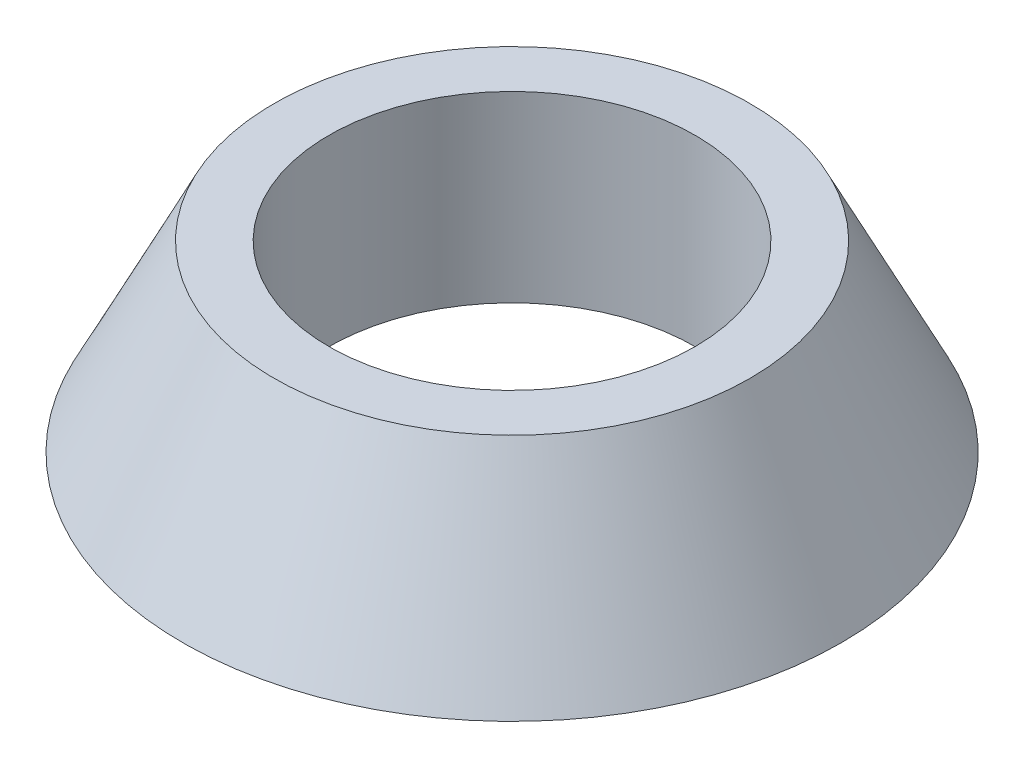
ISO-10303-21;
HEADER;
FILE_DESCRIPTION(('STEP AP214'),'2;1');
FILE_NAME('part.step','',(''),(''),'','','');
FILE_SCHEMA(('AUTOMOTIVE_DESIGN { 1 0 10303 214 1 1 1 1 }'));
ENDSEC;
DATA;
#1=APPLICATION_CONTEXT('core data for automotive mechanical design processes');
#2=APPLICATION_PROTOCOL_DEFINITION('international standard','automotive_design',2000,#1);
#3=PRODUCT_CONTEXT('',#1,'mechanical');
#4=PRODUCT('Part','Part','',(#3));
#5=PRODUCT_RELATED_PRODUCT_CATEGORY('part','',(#4));
#6=PRODUCT_DEFINITION_FORMATION('','',#4);
#7=PRODUCT_DEFINITION_CONTEXT('part definition',#1,'design');
#8=PRODUCT_DEFINITION('design','',#6,#7);
#9=PRODUCT_DEFINITION_SHAPE('','',#8);
#10=(LENGTH_UNIT() NAMED_UNIT(*) SI_UNIT(.MILLI.,.METRE.));
#11=(NAMED_UNIT(*) PLANE_ANGLE_UNIT() SI_UNIT($,.RADIAN.));
#12=(NAMED_UNIT(*) SI_UNIT($,.STERADIAN.) SOLID_ANGLE_UNIT());
#13=UNCERTAINTY_MEASURE_WITH_UNIT(LENGTH_MEASURE(1.E-05),#10,'distance_accuracy_value','');
#14=(GEOMETRIC_REPRESENTATION_CONTEXT(3) GLOBAL_UNCERTAINTY_ASSIGNED_CONTEXT((#13)) GLOBAL_UNIT_ASSIGNED_CONTEXT((#10,
#11,#12)) REPRESENTATION_CONTEXT('',''));
#15=CARTESIAN_POINT('',(0.,0.,0.));
#16=DIRECTION('',(0.,0.,1.));
#17=DIRECTION('',(1.,0.,0.));
#18=AXIS2_PLACEMENT_3D('',#15,#16,#17);
#19=CARTESIAN_POINT('',(9.,0.,0.));
#20=DIRECTION('',(0.,-1.,0.));
#21=DIRECTION('',(1.,0.,0.));
#22=AXIS2_PLACEMENT_3D('',#19,#20,#21);
#23=PLANE('',#22);
#24=CARTESIAN_POINT('',(0.,0.,0.));
#25=DIRECTION('',(0.,1.,0.));
#26=DIRECTION('',(1.,0.,0.));
#27=AXIS2_PLACEMENT_3D('',#24,#25,#26);
#28=CIRCLE('',#27,9.);
#29=CARTESIAN_POINT('',(9.,0.,0.));
#30=VERTEX_POINT('',#29);
#31=EDGE_CURVE('E49',#30,#30,#28,.T.);
#32=ORIENTED_EDGE('',*,*,#31,.F.);
#33=EDGE_LOOP('',(#32));
#34=FACE_BOUND('',#33,.T.);
#35=CARTESIAN_POINT('',(0.,0.,0.));
#36=DIRECTION('',(0.,1.,0.));
#37=DIRECTION('',(1.,0.,0.));
#38=AXIS2_PLACEMENT_3D('',#35,#36,#37);
#39=CIRCLE('',#38,5.);
#40=CARTESIAN_POINT('',(5.,0.,0.));
#41=VERTEX_POINT('',#40);
#42=EDGE_CURVE('E10',#41,#41,#39,.T.);
#43=ORIENTED_EDGE('',*,*,#42,.T.);
#44=EDGE_LOOP('',(#43));
#45=FACE_BOUND('',#44,.T.);
#46=ADVANCED_FACE('F35',(#34,#45),#23,.T.);
#47=CARTESIAN_POINT('',(0.,0.,0.));
#48=DIRECTION('',(0.,-1.,0.));
#49=DIRECTION('',(1.,0.,0.));
#50=AXIS2_PLACEMENT_3D('',#47,#48,#49);
#51=CYLINDRICAL_SURFACE('',#50,5.00000000000001);
#52=ORIENTED_EDGE('',*,*,#42,.F.);
#53=EDGE_LOOP('',(#52));
#54=FACE_BOUND('',#53,.T.);
#55=CARTESIAN_POINT('',(0.,4.99999999999998,0.));
#56=DIRECTION('',(0.,1.,0.));
#57=DIRECTION('',(1.,0.,0.));
#58=AXIS2_PLACEMENT_3D('',#55,#56,#57);
#59=CIRCLE('',#58,5.00000000000002);
#60=CARTESIAN_POINT('',(5.,5.,0.));
#61=VERTEX_POINT('',#60);
#62=EDGE_CURVE('E41',#61,#61,#59,.T.);
#63=ORIENTED_EDGE('',*,*,#62,.T.);
#64=EDGE_LOOP('',(#63));
#65=FACE_BOUND('',#64,.T.);
#66=ADVANCED_FACE('F58',(#54,#65),#51,.F.);
#67=CARTESIAN_POINT('',(5.,5.,0.));
#68=DIRECTION('',(0.,1.,0.));
#69=DIRECTION('',(-1.,0.,0.));
#70=AXIS2_PLACEMENT_3D('',#67,#68,#69);
#71=PLANE('',#70);
#72=ORIENTED_EDGE('',*,*,#62,.F.);
#73=EDGE_LOOP('',(#72));
#74=FACE_BOUND('',#73,.T.);
#75=CARTESIAN_POINT('',(0.,4.99999999999998,0.));
#76=DIRECTION('',(0.,1.,0.));
#77=DIRECTION('',(1.,0.,0.));
#78=AXIS2_PLACEMENT_3D('',#75,#76,#77);
#79=CIRCLE('',#78,6.50000000000002);
#80=CARTESIAN_POINT('',(6.5,5.,0.));
#81=VERTEX_POINT('',#80);
#82=EDGE_CURVE('E45',#81,#81,#79,.T.);
#83=ORIENTED_EDGE('',*,*,#82,.T.);
#84=EDGE_LOOP('',(#83));
#85=FACE_BOUND('',#84,.T.);
#86=ADVANCED_FACE('F62',(#74,#85),#71,.T.);
#87=CARTESIAN_POINT('',(0.,0.,0.));
#88=DIRECTION('',(0.,-1.,0.));
#89=DIRECTION('',(1.,0.,0.));
#90=AXIS2_PLACEMENT_3D('',#87,#88,#89);
#91=CONICAL_SURFACE('',#90,9.,0.463647609000802);
#92=ORIENTED_EDGE('',*,*,#82,.F.);
#93=EDGE_LOOP('',(#92));
#94=FACE_BOUND('',#93,.T.);
#95=ORIENTED_EDGE('',*,*,#31,.T.);
#96=EDGE_LOOP('',(#95));
#97=FACE_BOUND('',#96,.T.);
#98=ADVANCED_FACE('F55',(#94,#97),#91,.T.);
#99=CLOSED_SHELL('',(#46,#66,#86,#98));
#100=MANIFOLD_SOLID_BREP('B2',#99);
#101=ADVANCED_BREP_SHAPE_REPRESENTATION('',(#18,#100),#14);
#102=SHAPE_DEFINITION_REPRESENTATION(#9,#101);
ENDSEC;
END-ISO-10303-21;
